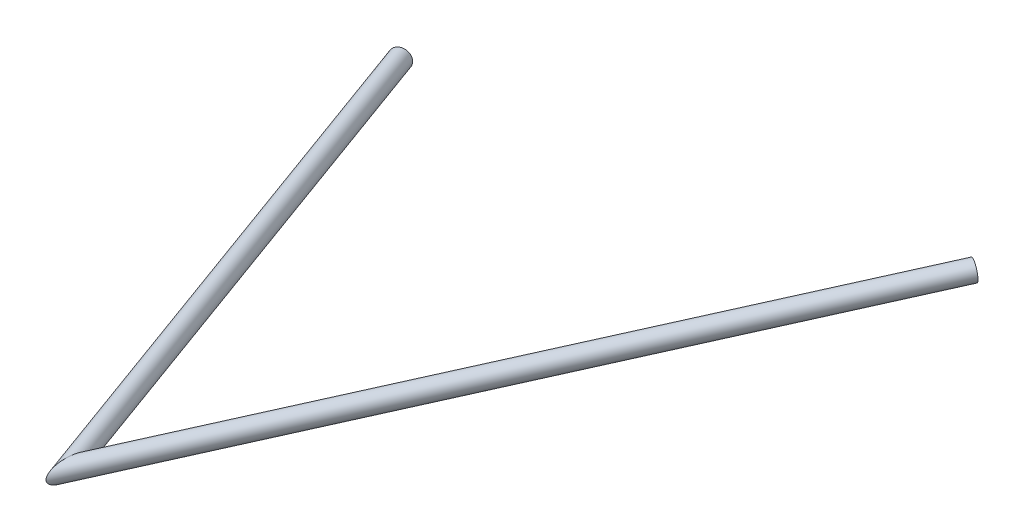
ISO-10303-21;
HEADER;
FILE_DESCRIPTION(('STEP AP214'),'2;1');
FILE_NAME('part.step','',(''),(''),'','','');
FILE_SCHEMA(('AUTOMOTIVE_DESIGN { 1 0 10303 214 1 1 1 1 }'));
ENDSEC;
DATA;
#1=APPLICATION_CONTEXT('core data for automotive mechanical design processes');
#2=APPLICATION_PROTOCOL_DEFINITION('international standard','automotive_design',2000,#1);
#3=PRODUCT_CONTEXT('',#1,'mechanical');
#4=PRODUCT('Part','Part','',(#3));
#5=PRODUCT_RELATED_PRODUCT_CATEGORY('part','',(#4));
#6=PRODUCT_DEFINITION_FORMATION('','',#4);
#7=PRODUCT_DEFINITION_CONTEXT('part definition',#1,'design');
#8=PRODUCT_DEFINITION('design','',#6,#7);
#9=PRODUCT_DEFINITION_SHAPE('','',#8);
#10=(LENGTH_UNIT() NAMED_UNIT(*) SI_UNIT(.MILLI.,.METRE.));
#11=(NAMED_UNIT(*) PLANE_ANGLE_UNIT() SI_UNIT($,.RADIAN.));
#12=(NAMED_UNIT(*) SI_UNIT($,.STERADIAN.) SOLID_ANGLE_UNIT());
#13=UNCERTAINTY_MEASURE_WITH_UNIT(LENGTH_MEASURE(1.E-05),#10,'distance_accuracy_value','');
#14=(GEOMETRIC_REPRESENTATION_CONTEXT(3) GLOBAL_UNCERTAINTY_ASSIGNED_CONTEXT((#13)) GLOBAL_UNIT_ASSIGNED_CONTEXT((#10,
#11,#12)) REPRESENTATION_CONTEXT('',''));
#15=CARTESIAN_POINT('',(0.,0.,0.));
#16=DIRECTION('',(0.,0.,1.));
#17=DIRECTION('',(1.,0.,0.));
#18=AXIS2_PLACEMENT_3D('',#15,#16,#17);
#19=CARTESIAN_POINT('',(35.3236092732803,-44.764253382644,16.4189973727112));
#20=DIRECTION('',(-0.366329956901291,-0.0441428209084016,-0.929437342718134));
#21=DIRECTION('',(-0.930344213795325,0.,0.366687392553328));
#22=AXIS2_PLACEMENT_3D('',#19,#20,#21);
#23=CYLINDRICAL_SURFACE('',#22,8.52500000000001);
#24=CARTESIAN_POINT('',(-182.037028919492,-70.9562465394166,-535.05949945097));
#25=DIRECTION('',(0.366329956901291,0.0441428209084016,0.929437342718135));
#26=DIRECTION('',(0.930344213795325,0.,-0.366687392553328));
#27=AXIS2_PLACEMENT_3D('',#24,#25,#26);
#28=CIRCLE('',#27,8.52500000000001);
#29=CARTESIAN_POINT('',(-174.105844496886,-70.9562465394166,-538.185509472487));
#30=VERTEX_POINT('',#29);
#31=EDGE_CURVE('E64',#30,#30,#28,.T.);
#32=ORIENTED_EDGE('',*,*,#31,.F.);
#33=EDGE_LOOP('',(#32));
#34=FACE_BOUND('',#33,.T.);
#35=CARTESIAN_POINT('',(35.3236092732804,-44.764253382644,16.4189973727114));
#36=DIRECTION('',(0.989691413365593,0.126529314706647,0.067091272385324));
#37=DIRECTION('',(0.0661742133624549,0.0114421040834749,-0.997742477666458));
#38=AXIS2_PLACEMENT_3D('',#35,#36,#37);
#39=ELLIPSE('',#38,19.8027342160401,8.52500000000001);
#40=CARTESIAN_POINT('',(36.6340396324526,-44.5376684366067,-3.33903172857083));
#41=VERTEX_POINT('',#40);
#42=EDGE_CURVE('E60',#41,#41,#39,.T.);
#43=ORIENTED_EDGE('',*,*,#42,.T.);
#44=EDGE_LOOP('',(#43));
#45=FACE_BOUND('',#44,.T.);
#46=ADVANCED_FACE('F56',(#34,#45),#23,.F.);
#47=CARTESIAN_POINT('',(35.3236092732803,-44.764253382644,16.4189973727112));
#48=DIRECTION('',(-0.366329956901291,-0.0441428209084016,-0.929437342718134));
#49=DIRECTION('',(-0.930344213795325,0.,0.366687392553328));
#50=AXIS2_PLACEMENT_3D('',#47,#48,#49);
#51=CYLINDRICAL_SURFACE('',#50,9.52499999999998);
#52=CARTESIAN_POINT('',(-182.037028919492,-70.9562465394166,-535.05949945097));
#53=DIRECTION('',(0.366329956901291,0.0441428209084016,0.929437342718135));
#54=DIRECTION('',(0.930344213795325,0.,-0.366687392553328));
#55=AXIS2_PLACEMENT_3D('',#52,#53,#54);
#56=CIRCLE('',#55,9.52499999999998);
#57=CARTESIAN_POINT('',(-173.175500283091,-70.9562465394166,-538.55219686504));
#58=VERTEX_POINT('',#57);
#59=EDGE_CURVE('E68',#58,#58,#56,.T.);
#60=ORIENTED_EDGE('',*,*,#59,.T.);
#61=EDGE_LOOP('',(#60));
#62=FACE_BOUND('',#61,.T.);
#63=CARTESIAN_POINT('',(35.3236092732804,-44.764253382644,16.4189973727114));
#64=DIRECTION('',(0.989691413365593,0.126529314706647,0.067091272385324));
#65=DIRECTION('',(0.0661742133624549,0.0114421040834749,-0.997742477666458));
#66=AXIS2_PLACEMENT_3D('',#63,#64,#65);
#67=ELLIPSE('',#66,22.1256355903556,9.52499999999998);
#68=CARTESIAN_POINT('',(36.7877558036165,-44.5110895573061,-5.6566891011552));
#69=VERTEX_POINT('',#68);
#70=EDGE_CURVE('E12',#69,#69,#67,.T.);
#71=ORIENTED_EDGE('',*,*,#70,.F.);
#72=EDGE_LOOP('',(#71));
#73=FACE_BOUND('',#72,.T.);
#74=ADVANCED_FACE('F83',(#62,#73),#51,.T.);
#75=CARTESIAN_POINT('',(-182.037028919492,-70.9562465394166,-535.05949945097));
#76=DIRECTION('',(0.366329956901291,0.0441428209084016,0.929437342718135));
#77=DIRECTION('',(0.930344213795325,0.,-0.366687392553328));
#78=AXIS2_PLACEMENT_3D('',#75,#76,#77);
#79=PLANE('',#78);
#80=ORIENTED_EDGE('',*,*,#31,.T.);
#81=EDGE_LOOP('',(#80));
#82=FACE_BOUND('',#81,.T.);
#83=ORIENTED_EDGE('',*,*,#59,.F.);
#84=EDGE_LOOP('',(#83));
#85=FACE_BOUND('',#84,.T.);
#86=ADVANCED_FACE('F79',(#82,#85),#79,.F.);
#87=CARTESIAN_POINT('',(35.3236092732804,-44.764253382644,16.4189973727113));
#88=DIRECTION('',(0.989691413365593,0.126529314706647,0.067091272385324));
#89=DIRECTION('',(-0.126815049020349,0.991926380001039,0.));
#90=AXIS2_PLACEMENT_3D('',#87,#88,#89);
#91=PLANE('',#90);
#92=ORIENTED_EDGE('',*,*,#42,.F.);
#93=EDGE_LOOP('',(#92));
#94=FACE_BOUND('',#93,.T.);
#95=ORIENTED_EDGE('',*,*,#70,.T.);
#96=EDGE_LOOP('',(#95));
#97=FACE_BOUND('',#96,.T.);
#98=ADVANCED_FACE('F58',(#94,#97),#91,.T.);
#99=CLOSED_SHELL('',(#46,#74,#86,#98));
#100=MANIFOLD_SOLID_BREP('B2',#99);
#101=CARTESIAN_POINT('',(362.156113564676,-1.16883704904958,-570.033587688609));
#102=DIRECTION('',(-0.485786645472501,-0.0647979340506234,0.871672279485441));
#103=DIRECTION('',(0.873508039157276,0.,0.486809722096437));
#104=AXIS2_PLACEMENT_3D('',#101,#102,#103);
#105=CYLINDRICAL_SURFACE('',#104,8.52500000000001);
#106=CARTESIAN_POINT('',(362.156113564676,-1.16883704904958,-570.033587688609));
#107=DIRECTION('',(0.485786645472501,0.0647979340506234,-0.871672279485441));
#108=DIRECTION('',(-0.843483974193522,-0.226779036376921,-0.486935369365029));
#109=AXIS2_PLACEMENT_3D('',#106,#107,#108);
#110=CIRCLE('',#109,8.52500000000001);
#111=CARTESIAN_POINT('',(354.965412684676,-3.10212833416283,-574.184711712446));
#112=VERTEX_POINT('',#111);
#113=EDGE_CURVE('E161',#112,#112,#110,.T.);
#114=ORIENTED_EDGE('',*,*,#113,.T.);
#115=EDGE_LOOP('',(#114));
#116=FACE_BOUND('',#115,.T.);
#117=CARTESIAN_POINT('',(35.3236092732803,-44.764253382644,16.4189973727116));
#118=DIRECTION('',(-0.989691413365593,-0.126529314706647,-0.0670912723853239));
#119=DIRECTION('',(-0.0661742133624548,-0.0114421040834749,0.997742477666459));
#120=AXIS2_PLACEMENT_3D('',#117,#118,#119);
#121=ELLIPSE('',#120,19.8027342160401,8.52500000000001);
#122=CARTESIAN_POINT('',(34.0131789141081,-44.9908383286813,36.1770264739938));
#123=VERTEX_POINT('',#122);
#124=EDGE_CURVE('E151',#123,#123,#121,.T.);
#125=ORIENTED_EDGE('',*,*,#124,.T.);
#126=EDGE_LOOP('',(#125));
#127=FACE_BOUND('',#126,.T.);
#128=ADVANCED_FACE('F147',(#116,#127),#105,.F.);
#129=CARTESIAN_POINT('',(362.156113564676,-1.16883704904958,-570.033587688609));
#130=DIRECTION('',(-0.485786645472501,-0.0647979340506234,0.871672279485441));
#131=DIRECTION('',(0.873508039157276,0.,0.486809722096437));
#132=AXIS2_PLACEMENT_3D('',#129,#130,#131);
#133=CYLINDRICAL_SURFACE('',#132,9.52499999999998);
#134=CARTESIAN_POINT('',(362.156113564676,-1.16883704904958,-570.033587688609));
#135=DIRECTION('',(0.485786645472501,0.0647979340506234,-0.871672279485441));
#136=DIRECTION('',(-0.843483974193522,-0.226779036376921,-0.486935369365029));
#137=AXIS2_PLACEMENT_3D('',#134,#135,#136);
#138=CIRCLE('',#137,9.52499999999998);
#139=CARTESIAN_POINT('',(354.121928710483,-3.32890737053975,-574.671647081811));
#140=VERTEX_POINT('',#139);
#141=EDGE_CURVE('E155',#140,#140,#138,.T.);
#142=ORIENTED_EDGE('',*,*,#141,.F.);
#143=EDGE_LOOP('',(#142));
#144=FACE_BOUND('',#143,.T.);
#145=CARTESIAN_POINT('',(35.3236092732803,-44.764253382644,16.4189973727116));
#146=DIRECTION('',(-0.989691413365593,-0.126529314706647,-0.0670912723853239));
#147=DIRECTION('',(-0.0661742133624548,-0.0114421040834749,0.997742477666459));
#148=AXIS2_PLACEMENT_3D('',#145,#146,#147);
#149=ELLIPSE('',#148,22.1256355903556,9.52499999999998);
#150=CARTESIAN_POINT('',(33.8594627429442,-45.0174172079819,38.4946838465782));
#151=VERTEX_POINT('',#150);
#152=EDGE_CURVE('E55',#151,#151,#149,.T.);
#153=ORIENTED_EDGE('',*,*,#152,.F.);
#154=EDGE_LOOP('',(#153));
#155=FACE_BOUND('',#154,.T.);
#156=ADVANCED_FACE('F174',(#144,#155),#133,.T.);
#157=CARTESIAN_POINT('',(362.156113564676,-1.16883704904958,-570.033587688609));
#158=DIRECTION('',(0.485786645472501,0.0647979340506234,-0.871672279485441));
#159=DIRECTION('',(-0.843483974193522,-0.226779036376921,-0.486935369365029));
#160=AXIS2_PLACEMENT_3D('',#157,#158,#159);
#161=PLANE('',#160);
#162=ORIENTED_EDGE('',*,*,#113,.F.);
#163=EDGE_LOOP('',(#162));
#164=FACE_BOUND('',#163,.T.);
#165=ORIENTED_EDGE('',*,*,#141,.T.);
#166=EDGE_LOOP('',(#165));
#167=FACE_BOUND('',#166,.T.);
#168=ADVANCED_FACE('F170',(#164,#167),#161,.T.);
#169=CARTESIAN_POINT('',(35.3236092732804,-44.764253382644,16.4189973727113));
#170=DIRECTION('',(-0.989691413365593,-0.126529314706647,-0.0670912723853239));
#171=DIRECTION('',(0.126815049020349,-0.991926380001039,0.));
#172=AXIS2_PLACEMENT_3D('',#169,#170,#171);
#173=PLANE('',#172);
#174=ORIENTED_EDGE('',*,*,#124,.F.);
#175=EDGE_LOOP('',(#174));
#176=FACE_BOUND('',#175,.T.);
#177=ORIENTED_EDGE('',*,*,#152,.T.);
#178=EDGE_LOOP('',(#177));
#179=FACE_BOUND('',#178,.T.);
#180=ADVANCED_FACE('F149',(#176,#179),#173,.T.);
#181=CLOSED_SHELL('',(#128,#156,#168,#180));
#182=MANIFOLD_SOLID_BREP('B7',#181);
#183=ADVANCED_BREP_SHAPE_REPRESENTATION('',(#18,#100,#182),#14);
#184=SHAPE_DEFINITION_REPRESENTATION(#9,#183);
ENDSEC;
END-ISO-10303-21;
